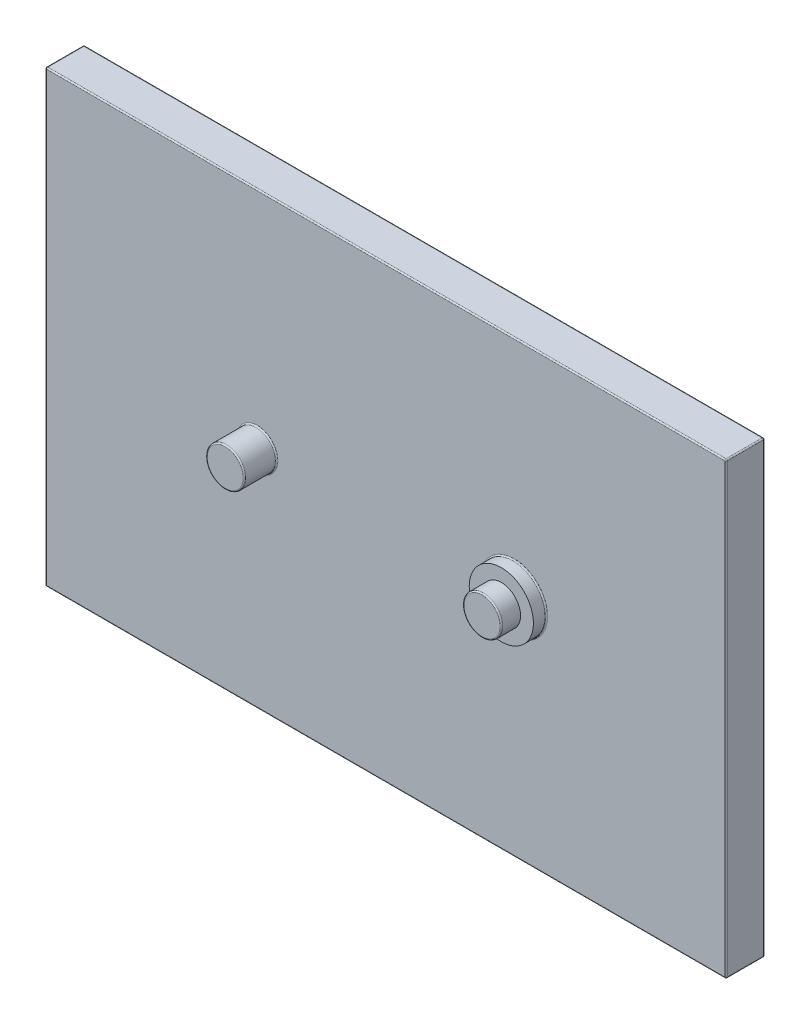
ISO-10303-21;
HEADER;
FILE_DESCRIPTION(('STEP AP214'),'2;1');
FILE_NAME('part.step','',(''),(''),'','','');
FILE_SCHEMA(('AUTOMOTIVE_DESIGN { 1 0 10303 214 1 1 1 1 }'));
ENDSEC;
DATA;
#1=APPLICATION_CONTEXT('core data for automotive mechanical design processes');
#2=APPLICATION_PROTOCOL_DEFINITION('international standard','automotive_design',2000,#1);
#3=PRODUCT_CONTEXT('',#1,'mechanical');
#4=PRODUCT('Part','Part','',(#3));
#5=PRODUCT_RELATED_PRODUCT_CATEGORY('part','',(#4));
#6=PRODUCT_DEFINITION_FORMATION('','',#4);
#7=PRODUCT_DEFINITION_CONTEXT('part definition',#1,'design');
#8=PRODUCT_DEFINITION('design','',#6,#7);
#9=PRODUCT_DEFINITION_SHAPE('','',#8);
#10=(LENGTH_UNIT() NAMED_UNIT(*) SI_UNIT(.MILLI.,.METRE.));
#11=(NAMED_UNIT(*) PLANE_ANGLE_UNIT() SI_UNIT($,.RADIAN.));
#12=(NAMED_UNIT(*) SI_UNIT($,.STERADIAN.) SOLID_ANGLE_UNIT());
#13=UNCERTAINTY_MEASURE_WITH_UNIT(LENGTH_MEASURE(1.E-05),#10,'distance_accuracy_value','');
#14=(GEOMETRIC_REPRESENTATION_CONTEXT(3) GLOBAL_UNCERTAINTY_ASSIGNED_CONTEXT((#13)) GLOBAL_UNIT_ASSIGNED_CONTEXT((#10,
#11,#12)) REPRESENTATION_CONTEXT('',''));
#15=CARTESIAN_POINT('',(0.,0.,0.));
#16=DIRECTION('',(0.,0.,1.));
#17=DIRECTION('',(1.,0.,0.));
#18=AXIS2_PLACEMENT_3D('',#15,#16,#17);
#19=CARTESIAN_POINT('',(265.,-175.,-10.));
#20=DIRECTION('',(0.,0.,1.));
#21=DIRECTION('',(1.,0.,0.));
#22=AXIS2_PLACEMENT_3D('',#19,#20,#21);
#23=PLANE('',#22);
#24=CARTESIAN_POINT('',(100.,0.,-10.));
#25=DIRECTION('',(0.,0.,1.));
#26=DIRECTION('',(1.,0.,0.));
#27=AXIS2_PLACEMENT_3D('',#24,#25,#26);
#28=CIRCLE('',#27,26.);
#29=CARTESIAN_POINT('',(126.,0.,-10.));
#30=VERTEX_POINT('',#29);
#31=EDGE_CURVE('E11',#30,#30,#28,.F.);
#32=ORIENTED_EDGE('',*,*,#31,.T.);
#33=EDGE_LOOP('',(#32));
#34=FACE_BOUND('',#33,.T.);
#35=CARTESIAN_POINT('',(-100.,0.,-10.));
#36=DIRECTION('',(0.,0.,1.));
#37=DIRECTION('',(1.,0.,0.));
#38=AXIS2_PLACEMENT_3D('',#35,#36,#37);
#39=CIRCLE('',#38,16.);
#40=CARTESIAN_POINT('',(-84.,0.,-10.));
#41=VERTEX_POINT('',#40);
#42=EDGE_CURVE('E43',#41,#41,#39,.F.);
#43=ORIENTED_EDGE('',*,*,#42,.T.);
#44=EDGE_LOOP('',(#43));
#45=FACE_BOUND('',#44,.T.);
#46=DIRECTION('',(0.,-1.,0.));
#47=VECTOR('',#46,1.);
#48=CARTESIAN_POINT('',(-264.,-175.,-10.));
#49=LINE('',#48,#47);
#50=CARTESIAN_POINT('',(-264.,174.,-10.));
#51=VERTEX_POINT('',#50);
#52=CARTESIAN_POINT('',(-264.,-174.,-10.));
#53=VERTEX_POINT('',#52);
#54=EDGE_CURVE('E51',#51,#53,#49,.T.);
#55=ORIENTED_EDGE('',*,*,#54,.T.);
#56=DIRECTION('',(1.,0.,0.));
#57=VECTOR('',#56,1.);
#58=CARTESIAN_POINT('',(265.,-174.,-10.));
#59=LINE('',#58,#57);
#60=CARTESIAN_POINT('',(264.,-174.,-10.));
#61=VERTEX_POINT('',#60);
#62=EDGE_CURVE('E225',#53,#61,#59,.T.);
#63=ORIENTED_EDGE('',*,*,#62,.T.);
#64=DIRECTION('',(0.,1.,0.));
#65=VECTOR('',#64,1.);
#66=CARTESIAN_POINT('',(264.,-175.,-10.));
#67=LINE('',#66,#65);
#68=CARTESIAN_POINT('',(264.,174.,-10.));
#69=VERTEX_POINT('',#68);
#70=EDGE_CURVE('E221',#61,#69,#67,.T.);
#71=ORIENTED_EDGE('',*,*,#70,.T.);
#72=DIRECTION('',(-1.,0.,0.));
#73=VECTOR('',#72,1.);
#74=CARTESIAN_POINT('',(265.,174.,-10.));
#75=LINE('',#74,#73);
#76=EDGE_CURVE('E56',#69,#51,#75,.T.);
#77=ORIENTED_EDGE('',*,*,#76,.T.);
#78=EDGE_LOOP('',(#55,#63,#71,#77));
#79=FACE_BOUND('',#78,.T.);
#80=ADVANCED_FACE('F34',(#34,#45,#79),#23,.T.);
#81=CARTESIAN_POINT('',(265.,175.,-40.));
#82=DIRECTION('',(1.,0.,0.));
#83=DIRECTION('',(0.,0.,-1.));
#84=AXIS2_PLACEMENT_3D('',#81,#82,#83);
#85=PLANE('',#84);
#86=DIRECTION('',(0.,1.,0.));
#87=VECTOR('',#86,1.);
#88=CARTESIAN_POINT('',(265.,175.,-11.));
#89=LINE('',#88,#87);
#90=CARTESIAN_POINT('',(265.,174.,-11.));
#91=VERTEX_POINT('',#90);
#92=CARTESIAN_POINT('',(265.,-174.,-11.));
#93=VERTEX_POINT('',#92);
#94=EDGE_CURVE('E196',#91,#93,#89,.F.);
#95=ORIENTED_EDGE('',*,*,#94,.T.);
#96=DIRECTION('',(0.,0.,1.));
#97=VECTOR('',#96,1.);
#98=CARTESIAN_POINT('',(265.,-174.,-40.));
#99=LINE('',#98,#97);
#100=CARTESIAN_POINT('',(265.,-174.,-39.));
#101=VERTEX_POINT('',#100);
#102=EDGE_CURVE('E201',#93,#101,#99,.F.);
#103=ORIENTED_EDGE('',*,*,#102,.T.);
#104=DIRECTION('',(0.,1.,0.));
#105=VECTOR('',#104,1.);
#106=CARTESIAN_POINT('',(265.,175.,-39.));
#107=LINE('',#106,#105);
#108=CARTESIAN_POINT('',(265.,174.,-39.));
#109=VERTEX_POINT('',#108);
#110=EDGE_CURVE('E198',#101,#109,#107,.T.);
#111=ORIENTED_EDGE('',*,*,#110,.T.);
#112=DIRECTION('',(0.,0.,1.));
#113=VECTOR('',#112,1.);
#114=CARTESIAN_POINT('',(265.,174.,-40.));
#115=LINE('',#114,#113);
#116=EDGE_CURVE('E194',#109,#91,#115,.T.);
#117=ORIENTED_EDGE('',*,*,#116,.T.);
#118=EDGE_LOOP('',(#95,#103,#111,#117));
#119=FACE_BOUND('',#118,.T.);
#120=ADVANCED_FACE('F308',(#119),#85,.T.);
#121=CARTESIAN_POINT('',(-265.,-175.,-40.));
#122=DIRECTION('',(0.,-1.,0.));
#123=DIRECTION('',(0.,0.,-1.));
#124=AXIS2_PLACEMENT_3D('',#121,#122,#123);
#125=PLANE('',#124);
#126=DIRECTION('',(1.,0.,0.));
#127=VECTOR('',#126,1.);
#128=CARTESIAN_POINT('',(265.,-175.,-39.));
#129=LINE('',#128,#127);
#130=CARTESIAN_POINT('',(-264.,-175.,-39.));
#131=VERTEX_POINT('',#130);
#132=CARTESIAN_POINT('',(264.,-175.,-39.));
#133=VERTEX_POINT('',#132);
#134=EDGE_CURVE('E189',#131,#133,#129,.T.);
#135=ORIENTED_EDGE('',*,*,#134,.T.);
#136=DIRECTION('',(0.,0.,1.));
#137=VECTOR('',#136,1.);
#138=CARTESIAN_POINT('',(264.,-175.,-40.));
#139=LINE('',#138,#137);
#140=CARTESIAN_POINT('',(264.,-175.,-11.));
#141=VERTEX_POINT('',#140);
#142=EDGE_CURVE('E192',#133,#141,#139,.T.);
#143=ORIENTED_EDGE('',*,*,#142,.T.);
#144=DIRECTION('',(1.,0.,0.));
#145=VECTOR('',#144,1.);
#146=CARTESIAN_POINT('',(-265.,-175.,-11.));
#147=LINE('',#146,#145);
#148=CARTESIAN_POINT('',(-264.,-175.,-11.));
#149=VERTEX_POINT('',#148);
#150=EDGE_CURVE('E187',#141,#149,#147,.F.);
#151=ORIENTED_EDGE('',*,*,#150,.T.);
#152=DIRECTION('',(0.,0.,1.));
#153=VECTOR('',#152,1.);
#154=CARTESIAN_POINT('',(-264.,-175.,-40.));
#155=LINE('',#154,#153);
#156=EDGE_CURVE('E185',#149,#131,#155,.F.);
#157=ORIENTED_EDGE('',*,*,#156,.T.);
#158=EDGE_LOOP('',(#135,#143,#151,#157));
#159=FACE_BOUND('',#158,.T.);
#160=ADVANCED_FACE('F314',(#159),#125,.T.);
#161=CARTESIAN_POINT('',(-265.,175.,-40.));
#162=DIRECTION('',(-1.,0.,0.));
#163=DIRECTION('',(0.,0.,1.));
#164=AXIS2_PLACEMENT_3D('',#161,#162,#163);
#165=PLANE('',#164);
#166=DIRECTION('',(0.,-1.,0.));
#167=VECTOR('',#166,1.);
#168=CARTESIAN_POINT('',(-265.,-175.,-39.));
#169=LINE('',#168,#167);
#170=CARTESIAN_POINT('',(-265.,174.,-39.));
#171=VERTEX_POINT('',#170);
#172=CARTESIAN_POINT('',(-265.,-174.,-39.));
#173=VERTEX_POINT('',#172);
#174=EDGE_CURVE('E180',#171,#173,#169,.T.);
#175=ORIENTED_EDGE('',*,*,#174,.T.);
#176=DIRECTION('',(0.,0.,1.));
#177=VECTOR('',#176,1.);
#178=CARTESIAN_POINT('',(-265.,-174.,-40.));
#179=LINE('',#178,#177);
#180=CARTESIAN_POINT('',(-265.,-174.,-11.));
#181=VERTEX_POINT('',#180);
#182=EDGE_CURVE('E183',#173,#181,#179,.T.);
#183=ORIENTED_EDGE('',*,*,#182,.T.);
#184=DIRECTION('',(0.,-1.,0.));
#185=VECTOR('',#184,1.);
#186=CARTESIAN_POINT('',(-265.,175.,-11.));
#187=LINE('',#186,#185);
#188=CARTESIAN_POINT('',(-265.,174.,-11.));
#189=VERTEX_POINT('',#188);
#190=EDGE_CURVE('E178',#181,#189,#187,.F.);
#191=ORIENTED_EDGE('',*,*,#190,.T.);
#192=DIRECTION('',(0.,0.,1.));
#193=VECTOR('',#192,1.);
#194=CARTESIAN_POINT('',(-265.,174.,-40.));
#195=LINE('',#194,#193);
#196=EDGE_CURVE('E176',#189,#171,#195,.F.);
#197=ORIENTED_EDGE('',*,*,#196,.T.);
#198=EDGE_LOOP('',(#175,#183,#191,#197));
#199=FACE_BOUND('',#198,.T.);
#200=ADVANCED_FACE('F324',(#199),#165,.T.);
#201=CARTESIAN_POINT('',(-265.,175.,-40.));
#202=DIRECTION('',(0.,1.,0.));
#203=DIRECTION('',(0.,0.,1.));
#204=AXIS2_PLACEMENT_3D('',#201,#202,#203);
#205=PLANE('',#204);
#206=DIRECTION('',(-1.,0.,0.));
#207=VECTOR('',#206,1.);
#208=CARTESIAN_POINT('',(-265.,175.,-39.));
#209=LINE('',#208,#207);
#210=CARTESIAN_POINT('',(264.,175.,-39.));
#211=VERTEX_POINT('',#210);
#212=CARTESIAN_POINT('',(-264.,175.,-39.));
#213=VERTEX_POINT('',#212);
#214=EDGE_CURVE('E135',#211,#213,#209,.T.);
#215=ORIENTED_EDGE('',*,*,#214,.T.);
#216=DIRECTION('',(0.,0.,1.));
#217=VECTOR('',#216,1.);
#218=CARTESIAN_POINT('',(-264.,175.,-40.));
#219=LINE('',#218,#217);
#220=CARTESIAN_POINT('',(-264.,175.,-11.));
#221=VERTEX_POINT('',#220);
#222=EDGE_CURVE('E131',#213,#221,#219,.T.);
#223=ORIENTED_EDGE('',*,*,#222,.T.);
#224=DIRECTION('',(-1.,0.,0.));
#225=VECTOR('',#224,1.);
#226=CARTESIAN_POINT('',(-265.,175.,-11.));
#227=LINE('',#226,#225);
#228=CARTESIAN_POINT('',(264.,175.,-11.));
#229=VERTEX_POINT('',#228);
#230=EDGE_CURVE('E123',#221,#229,#227,.F.);
#231=ORIENTED_EDGE('',*,*,#230,.T.);
#232=DIRECTION('',(0.,0.,1.));
#233=VECTOR('',#232,1.);
#234=CARTESIAN_POINT('',(264.,175.,-40.));
#235=LINE('',#234,#233);
#236=EDGE_CURVE('E128',#229,#211,#235,.F.);
#237=ORIENTED_EDGE('',*,*,#236,.T.);
#238=EDGE_LOOP('',(#215,#223,#231,#237));
#239=FACE_BOUND('',#238,.T.);
#240=ADVANCED_FACE('F126',(#239),#205,.T.);
#241=CARTESIAN_POINT('',(265.,-175.,-40.));
#242=DIRECTION('',(0.,0.,1.));
#243=DIRECTION('',(1.,0.,0.));
#244=AXIS2_PLACEMENT_3D('',#241,#242,#243);
#245=PLANE('',#244);
#246=DIRECTION('',(0.,-1.,0.));
#247=VECTOR('',#246,1.);
#248=CARTESIAN_POINT('',(-264.,175.,-40.));
#249=LINE('',#248,#247);
#250=CARTESIAN_POINT('',(-264.,-174.,-40.));
#251=VERTEX_POINT('',#250);
#252=CARTESIAN_POINT('',(-264.,174.,-40.));
#253=VERTEX_POINT('',#252);
#254=EDGE_CURVE('E171',#251,#253,#249,.F.);
#255=ORIENTED_EDGE('',*,*,#254,.T.);
#256=DIRECTION('',(-1.,0.,0.));
#257=VECTOR('',#256,1.);
#258=CARTESIAN_POINT('',(265.,174.,-40.));
#259=LINE('',#258,#257);
#260=CARTESIAN_POINT('',(264.,174.,-40.));
#261=VERTEX_POINT('',#260);
#262=EDGE_CURVE('E173',#253,#261,#259,.F.);
#263=ORIENTED_EDGE('',*,*,#262,.T.);
#264=DIRECTION('',(0.,1.,0.));
#265=VECTOR('',#264,1.);
#266=CARTESIAN_POINT('',(264.,-175.,-40.));
#267=LINE('',#266,#265);
#268=CARTESIAN_POINT('',(264.,-174.,-40.));
#269=VERTEX_POINT('',#268);
#270=EDGE_CURVE('E167',#261,#269,#267,.F.);
#271=ORIENTED_EDGE('',*,*,#270,.T.);
#272=DIRECTION('',(1.,0.,0.));
#273=VECTOR('',#272,1.);
#274=CARTESIAN_POINT('',(-265.,-174.,-40.));
#275=LINE('',#274,#273);
#276=EDGE_CURVE('E169',#269,#251,#275,.F.);
#277=ORIENTED_EDGE('',*,*,#276,.T.);
#278=EDGE_LOOP('',(#255,#263,#271,#277));
#279=FACE_BOUND('',#278,.T.);
#280=ADVANCED_FACE('F320',(#279),#245,.F.);
#281=CARTESIAN_POINT('',(-100.,0.,57.4264068711929));
#282=DIRECTION('',(0.,0.,-1.));
#283=DIRECTION('',(-1.,0.,0.));
#284=AXIS2_PLACEMENT_3D('',#281,#282,#283);
#285=CYLINDRICAL_SURFACE('',#284,15.);
#286=CARTESIAN_POINT('',(-100.,0.,14.));
#287=DIRECTION('',(0.,0.,-1.));
#288=DIRECTION('',(-1.,0.,0.));
#289=AXIS2_PLACEMENT_3D('',#286,#287,#288);
#290=CIRCLE('',#289,15.);
#291=CARTESIAN_POINT('',(-115.,0.,14.));
#292=VERTEX_POINT('',#291);
#293=EDGE_CURVE('E212',#292,#292,#290,.T.);
#294=ORIENTED_EDGE('',*,*,#293,.T.);
#295=EDGE_LOOP('',(#294));
#296=FACE_BOUND('',#295,.T.);
#297=CARTESIAN_POINT('',(-100.,0.,-9.));
#298=DIRECTION('',(0.,0.,1.));
#299=DIRECTION('',(1.,0.,0.));
#300=AXIS2_PLACEMENT_3D('',#297,#298,#299);
#301=CIRCLE('',#300,15.);
#302=CARTESIAN_POINT('',(-85.,0.,-9.));
#303=VERTEX_POINT('',#302);
#304=EDGE_CURVE('E209',#303,#303,#301,.T.);
#305=ORIENTED_EDGE('',*,*,#304,.T.);
#306=EDGE_LOOP('',(#305));
#307=FACE_BOUND('',#306,.T.);
#308=ADVANCED_FACE('F426',(#296,#307),#285,.T.);
#309=CARTESIAN_POINT('',(-42.5,57.5,15.));
#310=DIRECTION('',(0.,0.,-1.));
#311=DIRECTION('',(-1.,0.,0.));
#312=AXIS2_PLACEMENT_3D('',#309,#310,#311);
#313=PLANE('',#312);
#314=CARTESIAN_POINT('',(-100.,0.,15.));
#315=DIRECTION('',(0.,0.,-1.));
#316=DIRECTION('',(-1.,0.,0.));
#317=AXIS2_PLACEMENT_3D('',#314,#315,#316);
#318=CIRCLE('',#317,14.);
#319=CARTESIAN_POINT('',(-114.,0.,15.));
#320=VERTEX_POINT('',#319);
#321=EDGE_CURVE('E215',#320,#320,#318,.F.);
#322=ORIENTED_EDGE('',*,*,#321,.T.);
#323=EDGE_LOOP('',(#322));
#324=FACE_BOUND('',#323,.T.);
#325=ADVANCED_FACE('F305',(#324),#313,.F.);
#326=CARTESIAN_POINT('',(70.7106781186548,29.2893218813452,0.));
#327=DIRECTION('',(0.,0.,1.));
#328=DIRECTION('',(1.,0.,0.));
#329=AXIS2_PLACEMENT_3D('',#326,#327,#328);
#330=PLANE('',#329);
#331=CARTESIAN_POINT('',(100.,0.,0.));
#332=DIRECTION('',(0.,0.,1.));
#333=DIRECTION('',(1.,0.,0.));
#334=AXIS2_PLACEMENT_3D('',#331,#332,#333);
#335=CIRCLE('',#334,25.);
#336=CARTESIAN_POINT('',(75.,0.,0.));
#337=VERTEX_POINT('',#336);
#338=EDGE_CURVE('E161',#337,#337,#335,.T.);
#339=ORIENTED_EDGE('',*,*,#338,.T.);
#340=EDGE_LOOP('',(#339));
#341=FACE_BOUND('',#340,.T.);
#342=CARTESIAN_POINT('',(100.,0.,0.));
#343=DIRECTION('',(0.,0.,1.));
#344=DIRECTION('',(1.,0.,0.));
#345=AXIS2_PLACEMENT_3D('',#342,#343,#344);
#346=CIRCLE('',#345,15.);
#347=CARTESIAN_POINT('',(115.,0.,0.));
#348=VERTEX_POINT('',#347);
#349=EDGE_CURVE('E158',#348,#348,#346,.T.);
#350=ORIENTED_EDGE('',*,*,#349,.F.);
#351=EDGE_LOOP('',(#350));
#352=FACE_BOUND('',#351,.T.);
#353=ADVANCED_FACE('F290',(#341,#352),#330,.T.);
#354=CARTESIAN_POINT('',(100.,0.,70.7106781186547));
#355=DIRECTION('',(0.,0.,-1.));
#356=DIRECTION('',(-1.,0.,0.));
#357=AXIS2_PLACEMENT_3D('',#354,#355,#356);
#358=CYLINDRICAL_SURFACE('',#357,25.);
#359=CARTESIAN_POINT('',(100.,0.,-8.99999999999999));
#360=DIRECTION('',(0.,0.,1.));
#361=DIRECTION('',(1.,0.,0.));
#362=AXIS2_PLACEMENT_3D('',#359,#360,#361);
#363=CIRCLE('',#362,25.);
#364=CARTESIAN_POINT('',(75.,0.,-9.00000000000001));
#365=VERTEX_POINT('',#364);
#366=EDGE_CURVE('E218',#365,#365,#363,.T.);
#367=CARTESIAN_POINT('',(75.,0.,-9.00000000000001));
#368=CARTESIAN_POINT('',(75.,0.,-8.90625000000001));
#369=CARTESIAN_POINT('',(75.,0.,-8.81250000000001));
#370=CARTESIAN_POINT('',(75.,0.,-8.62500000000001));
#371=CARTESIAN_POINT('',(75.,0.,-8.53125000000001));
#372=CARTESIAN_POINT('',(75.,0.,-8.34375000000001));
#373=CARTESIAN_POINT('',(75.,0.,-8.25000000000001));
#374=CARTESIAN_POINT('',(75.,0.,-8.06250000000001));
#375=CARTESIAN_POINT('',(75.,0.,-7.96875000000001));
#376=CARTESIAN_POINT('',(75.,0.,-7.78125000000001));
#377=CARTESIAN_POINT('',(75.,0.,-7.68750000000001));
#378=CARTESIAN_POINT('',(75.,0.,-7.50000000000001));
#379=CARTESIAN_POINT('',(75.,0.,-7.40625));
#380=CARTESIAN_POINT('',(75.,0.,-7.21875));
#381=CARTESIAN_POINT('',(75.,0.,-7.125));
#382=CARTESIAN_POINT('',(75.,0.,-6.9375));
#383=CARTESIAN_POINT('',(75.,0.,-6.84375000000001));
#384=CARTESIAN_POINT('',(75.,0.,-6.65625000000001));
#385=CARTESIAN_POINT('',(75.,0.,-6.56250000000001));
#386=CARTESIAN_POINT('',(75.,0.,-6.37500000000001));
#387=CARTESIAN_POINT('',(75.,0.,-6.28125000000001));
#388=CARTESIAN_POINT('',(75.,0.,-6.09375000000001));
#389=CARTESIAN_POINT('',(75.,0.,-6.00000000000001));
#390=CARTESIAN_POINT('',(75.,0.,-5.8125));
#391=CARTESIAN_POINT('',(75.,0.,-5.71875));
#392=CARTESIAN_POINT('',(75.,0.,-5.53125000000001));
#393=CARTESIAN_POINT('',(75.,0.,-5.43750000000001));
#394=CARTESIAN_POINT('',(75.,0.,-5.25));
#395=CARTESIAN_POINT('',(75.,0.,-5.15625));
#396=CARTESIAN_POINT('',(75.,0.,-4.96875));
#397=CARTESIAN_POINT('',(75.,0.,-4.875));
#398=CARTESIAN_POINT('',(75.,0.,-4.6875));
#399=CARTESIAN_POINT('',(75.,0.,-4.59375));
#400=CARTESIAN_POINT('',(75.,0.,-4.40625));
#401=CARTESIAN_POINT('',(75.,0.,-4.31250000000001));
#402=CARTESIAN_POINT('',(75.,0.,-4.12500000000001));
#403=CARTESIAN_POINT('',(75.,0.,-4.03125000000001));
#404=CARTESIAN_POINT('',(75.,0.,-3.84375000000001));
#405=CARTESIAN_POINT('',(75.,0.,-3.75));
#406=CARTESIAN_POINT('',(75.,0.,-3.5625));
#407=CARTESIAN_POINT('',(75.,0.,-3.46875));
#408=CARTESIAN_POINT('',(75.,0.,-3.28125));
#409=CARTESIAN_POINT('',(75.,0.,-3.1875));
#410=CARTESIAN_POINT('',(75.,0.,-3.));
#411=CARTESIAN_POINT('',(75.,0.,-2.90625));
#412=CARTESIAN_POINT('',(75.,0.,-2.71875));
#413=CARTESIAN_POINT('',(75.,0.,-2.625));
#414=CARTESIAN_POINT('',(75.,0.,-2.4375));
#415=CARTESIAN_POINT('',(75.,0.,-2.34375));
#416=CARTESIAN_POINT('',(75.,0.,-2.15625));
#417=CARTESIAN_POINT('',(75.,0.,-2.0625));
#418=CARTESIAN_POINT('',(75.,0.,-1.87500000000001));
#419=CARTESIAN_POINT('',(75.,0.,-1.78125000000001));
#420=CARTESIAN_POINT('',(75.,0.,-1.59375));
#421=CARTESIAN_POINT('',(75.,0.,-1.5));
#422=CARTESIAN_POINT('',(75.,0.,-1.3125));
#423=CARTESIAN_POINT('',(75.,0.,-1.21875));
#424=CARTESIAN_POINT('',(75.,0.,-1.03125));
#425=CARTESIAN_POINT('',(75.,0.,-0.937500000000003));
#426=CARTESIAN_POINT('',(75.,0.,-0.750000000000001));
#427=CARTESIAN_POINT('',(75.,0.,-0.656249999999997));
#428=CARTESIAN_POINT('',(75.,0.,-0.468749999999995));
#429=CARTESIAN_POINT('',(75.,0.,-0.374999999999996));
#430=CARTESIAN_POINT('',(75.,0.,-0.187499999999998));
#431=CARTESIAN_POINT('',(75.,0.,-0.0937499999999989));
#432=CARTESIAN_POINT('',(75.,0.,0.));
#433=B_SPLINE_CURVE_WITH_KNOTS('',3,(#367,#368,#369,#370,#371,#372,#373,#374,#375,#376,#377,
#378,#379,#380,#381,#382,#383,#384,#385,#386,#387,#388,#389,#390,#391,#392,#393,#394,#395,#396,
#397,#398,#399,#400,#401,#402,#403,#404,#405,#406,#407,#408,#409,#410,#411,#412,#413,#414,#415,
#416,#417,#418,#419,#420,#421,#422,#423,#424,#425,#426,#427,#428,#429,#430,#431,#432),
.UNSPECIFIED.,.F.,.F.,(4,2,2,2,2,2,2,2,2,2,2,2,2,2,2,2,2,2,2,2,2,2,2,2,2,2,2,2,2,2,2,2,4),(0.,
0.281249999999997,0.562499999999994,0.843750000000004,1.125,1.40625,1.68750000000001,
1.96875000000001,2.25,2.53125,2.8125,3.09375000000001,3.375,3.65625,3.93750000000001,
4.21875000000001,4.5,4.78125,5.0625,5.34375000000001,5.62500000000001,5.90625,6.18750000000001,
6.46875000000001,6.75000000000001,7.03125,7.3125,7.59375000000001,7.87500000000001,8.15625,
8.43750000000001,8.71875000000001,9.00000000000001),.UNSPECIFIED.);
#434=EDGE_CURVE('BSEAM293',#365,#337,#433,.T.);
#435=ORIENTED_EDGE('',*,*,#366,.T.);
#436=ORIENTED_EDGE('',*,*,#338,.F.);
#437=ORIENTED_EDGE('',*,*,#434,.T.);
#438=ORIENTED_EDGE('',*,*,#434,.F.);
#439=EDGE_LOOP('',(#435,#437,#436,#438));
#440=FACE_BOUND('',#439,.T.);
#441=ADVANCED_FACE('F293',(#440),#358,.T.);
#442=CARTESIAN_POINT('',(-42.5,57.5,15.));
#443=DIRECTION('',(0.,0.,-1.));
#444=DIRECTION('',(-1.,0.,0.));
#445=AXIS2_PLACEMENT_3D('',#442,#443,#444);
#446=PLANE('',#445);
#447=CARTESIAN_POINT('',(100.,0.,15.));
#448=DIRECTION('',(0.,0.,-1.));
#449=DIRECTION('',(-1.,0.,0.));
#450=AXIS2_PLACEMENT_3D('',#447,#448,#449);
#451=CIRCLE('',#450,14.);
#452=CARTESIAN_POINT('',(86.,0.,15.));
#453=VERTEX_POINT('',#452);
#454=EDGE_CURVE('E206',#453,#453,#451,.F.);
#455=ORIENTED_EDGE('',*,*,#454,.T.);
#456=EDGE_LOOP('',(#455));
#457=FACE_BOUND('',#456,.T.);
#458=ADVANCED_FACE('F295',(#457),#446,.F.);
#459=CARTESIAN_POINT('',(100.,0.,57.4264068711929));
#460=DIRECTION('',(0.,0.,-1.));
#461=DIRECTION('',(-1.,0.,0.));
#462=AXIS2_PLACEMENT_3D('',#459,#460,#461);
#463=CYLINDRICAL_SURFACE('',#462,15.);
#464=CARTESIAN_POINT('',(100.,0.,14.));
#465=DIRECTION('',(0.,0.,-1.));
#466=DIRECTION('',(-1.,0.,0.));
#467=AXIS2_PLACEMENT_3D('',#464,#465,#466);
#468=CIRCLE('',#467,15.);
#469=CARTESIAN_POINT('',(85.,0.,14.));
#470=VERTEX_POINT('',#469);
#471=EDGE_CURVE('E203',#470,#470,#468,.T.);
#472=ORIENTED_EDGE('',*,*,#471,.T.);
#473=EDGE_LOOP('',(#472));
#474=FACE_BOUND('',#473,.T.);
#475=ORIENTED_EDGE('',*,*,#349,.T.);
#476=EDGE_LOOP('',(#475));
#477=FACE_BOUND('',#476,.T.);
#478=ADVANCED_FACE('F302',(#474,#477),#463,.T.);
#479=CARTESIAN_POINT('',(265.,-174.,-11.));
#480=DIRECTION('',(1.,0.,0.));
#481=DIRECTION('',(0.,0.,-1.));
#482=AXIS2_PLACEMENT_3D('',#479,#480,#481);
#483=CYLINDRICAL_SURFACE('',#482,1.);
#484=CARTESIAN_POINT('',(264.,-174.,-11.));
#485=DIRECTION('',(1.,0.,0.));
#486=DIRECTION('',(0.,0.,-1.));
#487=AXIS2_PLACEMENT_3D('',#484,#485,#486);
#488=CIRCLE('',#487,1.);
#489=EDGE_CURVE('E38',#61,#141,#488,.T.);
#490=ORIENTED_EDGE('',*,*,#489,.F.);
#491=ORIENTED_EDGE('',*,*,#62,.F.);
#492=CARTESIAN_POINT('',(-264.,-174.,-11.));
#493=DIRECTION('',(-1.,0.,0.));
#494=DIRECTION('',(0.,0.,1.));
#495=AXIS2_PLACEMENT_3D('',#492,#493,#494);
#496=CIRCLE('',#495,1.);
#497=EDGE_CURVE('E276',#149,#53,#496,.T.);
#498=ORIENTED_EDGE('',*,*,#497,.F.);
#499=ORIENTED_EDGE('',*,*,#150,.F.);
#500=EDGE_LOOP('',(#490,#491,#498,#499));
#501=FACE_BOUND('',#500,.T.);
#502=ADVANCED_FACE('F400',(#501),#483,.T.);
#503=CARTESIAN_POINT('',(264.,-174.,-11.));
#504=DIRECTION('',(0.,0.,1.));
#505=DIRECTION('',(1.,0.,0.));
#506=AXIS2_PLACEMENT_3D('',#503,#504,#505);
#507=SPHERICAL_SURFACE('',#506,1.);
#508=CARTESIAN_POINT('',(264.,-174.,-11.));
#509=DIRECTION('',(0.,-1.,0.));
#510=DIRECTION('',(0.,0.,-1.));
#511=AXIS2_PLACEMENT_3D('',#508,#509,#510);
#512=CIRCLE('',#511,1.);
#513=EDGE_CURVE('E271',#61,#93,#512,.F.);
#514=ORIENTED_EDGE('',*,*,#513,.F.);
#515=ORIENTED_EDGE('',*,*,#489,.T.);
#516=CARTESIAN_POINT('',(264.,-174.,-11.));
#517=DIRECTION('',(0.,0.,1.));
#518=DIRECTION('',(1.,0.,0.));
#519=AXIS2_PLACEMENT_3D('',#516,#517,#518);
#520=CIRCLE('',#519,1.);
#521=EDGE_CURVE('E274',#93,#141,#520,.F.);
#522=ORIENTED_EDGE('',*,*,#521,.F.);
#523=EDGE_LOOP('',(#514,#515,#522));
#524=FACE_BOUND('',#523,.T.);
#525=ADVANCED_FACE('F397',(#524),#507,.T.);
#526=CARTESIAN_POINT('',(-264.,-174.,-11.));
#527=DIRECTION('',(0.,0.,1.));
#528=DIRECTION('',(1.,0.,0.));
#529=AXIS2_PLACEMENT_3D('',#526,#527,#528);
#530=SPHERICAL_SURFACE('',#529,1.);
#531=CARTESIAN_POINT('',(-264.,-174.,-11.));
#532=DIRECTION('',(0.,0.,1.));
#533=DIRECTION('',(1.,0.,0.));
#534=AXIS2_PLACEMENT_3D('',#531,#532,#533);
#535=CIRCLE('',#534,1.);
#536=EDGE_CURVE('E265',#149,#181,#535,.F.);
#537=ORIENTED_EDGE('',*,*,#536,.F.);
#538=ORIENTED_EDGE('',*,*,#497,.T.);
#539=CARTESIAN_POINT('',(-264.,-174.,-11.));
#540=DIRECTION('',(0.,-1.,0.));
#541=DIRECTION('',(0.,0.,-1.));
#542=AXIS2_PLACEMENT_3D('',#539,#540,#541);
#543=CIRCLE('',#542,1.);
#544=EDGE_CURVE('E268',#181,#53,#543,.F.);
#545=ORIENTED_EDGE('',*,*,#544,.F.);
#546=EDGE_LOOP('',(#537,#538,#545));
#547=FACE_BOUND('',#546,.T.);
#548=ADVANCED_FACE('F393',(#547),#530,.T.);
#549=CARTESIAN_POINT('',(264.,-174.,-40.));
#550=DIRECTION('',(0.,0.,1.));
#551=DIRECTION('',(1.,0.,0.));
#552=AXIS2_PLACEMENT_3D('',#549,#550,#551);
#553=CYLINDRICAL_SURFACE('',#552,1.);
#554=ORIENTED_EDGE('',*,*,#521,.T.);
#555=ORIENTED_EDGE('',*,*,#142,.F.);
#556=CARTESIAN_POINT('',(264.,-174.,-39.));
#557=DIRECTION('',(0.,0.,-1.));
#558=DIRECTION('',(-1.,0.,0.));
#559=AXIS2_PLACEMENT_3D('',#556,#557,#558);
#560=CIRCLE('',#559,1.);
#561=EDGE_CURVE('E260',#101,#133,#560,.T.);
#562=ORIENTED_EDGE('',*,*,#561,.F.);
#563=ORIENTED_EDGE('',*,*,#102,.F.);
#564=EDGE_LOOP('',(#554,#555,#562,#563));
#565=FACE_BOUND('',#564,.T.);
#566=ADVANCED_FACE('F389',(#565),#553,.T.);
#567=CARTESIAN_POINT('',(264.,-175.,-11.));
#568=DIRECTION('',(0.,1.,0.));
#569=DIRECTION('',(0.,0.,1.));
#570=AXIS2_PLACEMENT_3D('',#567,#568,#569);
#571=CYLINDRICAL_SURFACE('',#570,1.);
#572=ORIENTED_EDGE('',*,*,#513,.T.);
#573=ORIENTED_EDGE('',*,*,#94,.F.);
#574=CARTESIAN_POINT('',(264.,174.,-11.));
#575=DIRECTION('',(0.,1.,0.));
#576=DIRECTION('',(0.,0.,1.));
#577=AXIS2_PLACEMENT_3D('',#574,#575,#576);
#578=CIRCLE('',#577,1.);
#579=EDGE_CURVE('E144',#69,#91,#578,.T.);
#580=ORIENTED_EDGE('',*,*,#579,.F.);
#581=ORIENTED_EDGE('',*,*,#70,.F.);
#582=EDGE_LOOP('',(#572,#573,#580,#581));
#583=FACE_BOUND('',#582,.T.);
#584=ADVANCED_FACE('F386',(#583),#571,.T.);
#585=CARTESIAN_POINT('',(265.,174.,-11.));
#586=DIRECTION('',(-1.,0.,0.));
#587=DIRECTION('',(0.,0.,1.));
#588=AXIS2_PLACEMENT_3D('',#585,#586,#587);
#589=CYLINDRICAL_SURFACE('',#588,1.);
#590=CARTESIAN_POINT('',(-264.,174.,-11.));
#591=DIRECTION('',(-1.,0.,0.));
#592=DIRECTION('',(0.,0.,1.));
#593=AXIS2_PLACEMENT_3D('',#590,#591,#592);
#594=CIRCLE('',#593,1.);
#595=EDGE_CURVE('E145',#51,#221,#594,.T.);
#596=ORIENTED_EDGE('',*,*,#595,.F.);
#597=ORIENTED_EDGE('',*,*,#76,.F.);
#598=CARTESIAN_POINT('',(264.,174.,-11.));
#599=DIRECTION('',(1.,0.,0.));
#600=DIRECTION('',(0.,0.,-1.));
#601=AXIS2_PLACEMENT_3D('',#598,#599,#600);
#602=CIRCLE('',#601,1.);
#603=EDGE_CURVE('E138',#229,#69,#602,.T.);
#604=ORIENTED_EDGE('',*,*,#603,.F.);
#605=ORIENTED_EDGE('',*,*,#230,.F.);
#606=EDGE_LOOP('',(#596,#597,#604,#605));
#607=FACE_BOUND('',#606,.T.);
#608=ADVANCED_FACE('F140',(#607),#589,.T.);
#609=CARTESIAN_POINT('',(-264.,-175.,-11.));
#610=DIRECTION('',(0.,-1.,0.));
#611=DIRECTION('',(0.,0.,-1.));
#612=AXIS2_PLACEMENT_3D('',#609,#610,#611);
#613=CYLINDRICAL_SURFACE('',#612,1.);
#614=ORIENTED_EDGE('',*,*,#544,.T.);
#615=ORIENTED_EDGE('',*,*,#54,.F.);
#616=CARTESIAN_POINT('',(-264.,174.,-11.));
#617=DIRECTION('',(0.,1.,0.));
#618=DIRECTION('',(0.,0.,1.));
#619=AXIS2_PLACEMENT_3D('',#616,#617,#618);
#620=CIRCLE('',#619,1.);
#621=EDGE_CURVE('E255',#189,#51,#620,.T.);
#622=ORIENTED_EDGE('',*,*,#621,.F.);
#623=ORIENTED_EDGE('',*,*,#190,.F.);
#624=EDGE_LOOP('',(#614,#615,#622,#623));
#625=FACE_BOUND('',#624,.T.);
#626=ADVANCED_FACE('F379',(#625),#613,.T.);
#627=CARTESIAN_POINT('',(-264.,-174.,-40.));
#628=DIRECTION('',(0.,0.,1.));
#629=DIRECTION('',(1.,0.,0.));
#630=AXIS2_PLACEMENT_3D('',#627,#628,#629);
#631=CYLINDRICAL_SURFACE('',#630,1.);
#632=ORIENTED_EDGE('',*,*,#536,.T.);
#633=ORIENTED_EDGE('',*,*,#182,.F.);
#634=CARTESIAN_POINT('',(-264.,-174.,-39.));
#635=DIRECTION('',(0.,0.,-1.));
#636=DIRECTION('',(-1.,0.,0.));
#637=AXIS2_PLACEMENT_3D('',#634,#635,#636);
#638=CIRCLE('',#637,1.);
#639=EDGE_CURVE('E252',#131,#173,#638,.T.);
#640=ORIENTED_EDGE('',*,*,#639,.F.);
#641=ORIENTED_EDGE('',*,*,#156,.F.);
#642=EDGE_LOOP('',(#632,#633,#640,#641));
#643=FACE_BOUND('',#642,.T.);
#644=ADVANCED_FACE('F375',(#643),#631,.T.);
#645=CARTESIAN_POINT('',(-265.,-174.,-39.));
#646=DIRECTION('',(-1.,0.,0.));
#647=DIRECTION('',(0.,0.,1.));
#648=AXIS2_PLACEMENT_3D('',#645,#646,#647);
#649=CYLINDRICAL_SURFACE('',#648,1.);
#650=CARTESIAN_POINT('',(264.,-174.,-39.));
#651=DIRECTION('',(1.,0.,0.));
#652=DIRECTION('',(0.,0.,-1.));
#653=AXIS2_PLACEMENT_3D('',#650,#651,#652);
#654=CIRCLE('',#653,1.);
#655=EDGE_CURVE('E262',#133,#269,#654,.T.);
#656=ORIENTED_EDGE('',*,*,#655,.F.);
#657=ORIENTED_EDGE('',*,*,#134,.F.);
#658=CARTESIAN_POINT('',(-264.,-174.,-39.));
#659=DIRECTION('',(-1.,0.,0.));
#660=DIRECTION('',(0.,0.,1.));
#661=AXIS2_PLACEMENT_3D('',#658,#659,#660);
#662=CIRCLE('',#661,1.);
#663=EDGE_CURVE('E249',#251,#131,#662,.T.);
#664=ORIENTED_EDGE('',*,*,#663,.F.);
#665=ORIENTED_EDGE('',*,*,#276,.F.);
#666=EDGE_LOOP('',(#656,#657,#664,#665));
#667=FACE_BOUND('',#666,.T.);
#668=ADVANCED_FACE('F371',(#667),#649,.T.);
#669=CARTESIAN_POINT('',(264.,-174.,-39.));
#670=DIRECTION('',(0.,0.,1.));
#671=DIRECTION('',(1.,0.,0.));
#672=AXIS2_PLACEMENT_3D('',#669,#670,#671);
#673=SPHERICAL_SURFACE('',#672,1.);
#674=ORIENTED_EDGE('',*,*,#561,.T.);
#675=ORIENTED_EDGE('',*,*,#655,.T.);
#676=CARTESIAN_POINT('',(264.,-174.,-39.));
#677=DIRECTION('',(0.,-1.,0.));
#678=DIRECTION('',(0.,0.,-1.));
#679=AXIS2_PLACEMENT_3D('',#676,#677,#678);
#680=CIRCLE('',#679,1.);
#681=EDGE_CURVE('E152',#101,#269,#680,.F.);
#682=ORIENTED_EDGE('',*,*,#681,.F.);
#683=EDGE_LOOP('',(#674,#675,#682));
#684=FACE_BOUND('',#683,.T.);
#685=ADVANCED_FACE('F368',(#684),#673,.T.);
#686=CARTESIAN_POINT('',(264.,174.,-11.));
#687=DIRECTION('',(0.,0.,1.));
#688=DIRECTION('',(1.,0.,0.));
#689=AXIS2_PLACEMENT_3D('',#686,#687,#688);
#690=SPHERICAL_SURFACE('',#689,1.);
#691=ORIENTED_EDGE('',*,*,#603,.T.);
#692=ORIENTED_EDGE('',*,*,#579,.T.);
#693=CARTESIAN_POINT('',(264.,174.,-11.));
#694=DIRECTION('',(0.,0.,1.));
#695=DIRECTION('',(1.,0.,0.));
#696=AXIS2_PLACEMENT_3D('',#693,#694,#695);
#697=CIRCLE('',#696,1.);
#698=EDGE_CURVE('E148',#229,#91,#697,.F.);
#699=ORIENTED_EDGE('',*,*,#698,.F.);
#700=EDGE_LOOP('',(#691,#692,#699));
#701=FACE_BOUND('',#700,.T.);
#702=ADVANCED_FACE('F149',(#701),#690,.T.);
#703=CARTESIAN_POINT('',(-264.,174.,-11.));
#704=DIRECTION('',(0.,0.,1.));
#705=DIRECTION('',(1.,0.,0.));
#706=AXIS2_PLACEMENT_3D('',#703,#704,#705);
#707=SPHERICAL_SURFACE('',#706,1.);
#708=ORIENTED_EDGE('',*,*,#621,.T.);
#709=ORIENTED_EDGE('',*,*,#595,.T.);
#710=CARTESIAN_POINT('',(-264.,174.,-11.));
#711=DIRECTION('',(0.,0.,1.));
#712=DIRECTION('',(1.,0.,0.));
#713=AXIS2_PLACEMENT_3D('',#710,#711,#712);
#714=CIRCLE('',#713,1.);
#715=EDGE_CURVE('E153',#189,#221,#714,.F.);
#716=ORIENTED_EDGE('',*,*,#715,.F.);
#717=EDGE_LOOP('',(#708,#709,#716));
#718=FACE_BOUND('',#717,.T.);
#719=ADVANCED_FACE('F361',(#718),#707,.T.);
#720=CARTESIAN_POINT('',(-264.,-174.,-39.));
#721=DIRECTION('',(0.,0.,1.));
#722=DIRECTION('',(1.,0.,0.));
#723=AXIS2_PLACEMENT_3D('',#720,#721,#722);
#724=SPHERICAL_SURFACE('',#723,1.);
#725=ORIENTED_EDGE('',*,*,#663,.T.);
#726=ORIENTED_EDGE('',*,*,#639,.T.);
#727=CARTESIAN_POINT('',(-264.,-174.,-39.));
#728=DIRECTION('',(0.,-1.,0.));
#729=DIRECTION('',(0.,0.,-1.));
#730=AXIS2_PLACEMENT_3D('',#727,#728,#729);
#731=CIRCLE('',#730,1.);
#732=EDGE_CURVE('E243',#251,#173,#731,.F.);
#733=ORIENTED_EDGE('',*,*,#732,.F.);
#734=EDGE_LOOP('',(#725,#726,#733));
#735=FACE_BOUND('',#734,.T.);
#736=ADVANCED_FACE('F357',(#735),#724,.T.);
#737=CARTESIAN_POINT('',(264.,175.,-39.));
#738=DIRECTION('',(0.,-1.,0.));
#739=DIRECTION('',(0.,0.,-1.));
#740=AXIS2_PLACEMENT_3D('',#737,#738,#739);
#741=CYLINDRICAL_SURFACE('',#740,1.);
#742=ORIENTED_EDGE('',*,*,#681,.T.);
#743=ORIENTED_EDGE('',*,*,#270,.F.);
#744=CARTESIAN_POINT('',(264.,174.,-39.));
#745=DIRECTION('',(0.,1.,0.));
#746=DIRECTION('',(0.,0.,1.));
#747=AXIS2_PLACEMENT_3D('',#744,#745,#746);
#748=CIRCLE('',#747,1.);
#749=EDGE_CURVE('E240',#109,#261,#748,.T.);
#750=ORIENTED_EDGE('',*,*,#749,.F.);
#751=ORIENTED_EDGE('',*,*,#110,.F.);
#752=EDGE_LOOP('',(#742,#743,#750,#751));
#753=FACE_BOUND('',#752,.T.);
#754=ADVANCED_FACE('F354',(#753),#741,.T.);
#755=CARTESIAN_POINT('',(264.,174.,-40.));
#756=DIRECTION('',(0.,0.,1.));
#757=DIRECTION('',(1.,0.,0.));
#758=AXIS2_PLACEMENT_3D('',#755,#756,#757);
#759=CYLINDRICAL_SURFACE('',#758,1.);
#760=ORIENTED_EDGE('',*,*,#698,.T.);
#761=ORIENTED_EDGE('',*,*,#116,.F.);
#762=CARTESIAN_POINT('',(264.,174.,-39.));
#763=DIRECTION('',(0.,0.,-1.));
#764=DIRECTION('',(-1.,0.,0.));
#765=AXIS2_PLACEMENT_3D('',#762,#763,#764);
#766=CIRCLE('',#765,1.);
#767=EDGE_CURVE('E156',#211,#109,#766,.T.);
#768=ORIENTED_EDGE('',*,*,#767,.F.);
#769=ORIENTED_EDGE('',*,*,#236,.F.);
#770=EDGE_LOOP('',(#760,#761,#768,#769));
#771=FACE_BOUND('',#770,.T.);
#772=ADVANCED_FACE('F155',(#771),#759,.T.);
#773=CARTESIAN_POINT('',(-264.,174.,-40.));
#774=DIRECTION('',(0.,0.,1.));
#775=DIRECTION('',(1.,0.,0.));
#776=AXIS2_PLACEMENT_3D('',#773,#774,#775);
#777=CYLINDRICAL_SURFACE('',#776,1.);
#778=ORIENTED_EDGE('',*,*,#715,.T.);
#779=ORIENTED_EDGE('',*,*,#222,.F.);
#780=CARTESIAN_POINT('',(-264.,174.,-39.));
#781=DIRECTION('',(0.,0.,-1.));
#782=DIRECTION('',(-1.,0.,0.));
#783=AXIS2_PLACEMENT_3D('',#780,#781,#782);
#784=CIRCLE('',#783,1.);
#785=EDGE_CURVE('E236',#171,#213,#784,.T.);
#786=ORIENTED_EDGE('',*,*,#785,.F.);
#787=ORIENTED_EDGE('',*,*,#196,.F.);
#788=EDGE_LOOP('',(#778,#779,#786,#787));
#789=FACE_BOUND('',#788,.T.);
#790=ADVANCED_FACE('F347',(#789),#777,.T.);
#791=CARTESIAN_POINT('',(-264.,175.,-39.));
#792=DIRECTION('',(0.,1.,0.));
#793=DIRECTION('',(0.,0.,1.));
#794=AXIS2_PLACEMENT_3D('',#791,#792,#793);
#795=CYLINDRICAL_SURFACE('',#794,1.);
#796=ORIENTED_EDGE('',*,*,#732,.T.);
#797=ORIENTED_EDGE('',*,*,#174,.F.);
#798=CARTESIAN_POINT('',(-264.,174.,-39.));
#799=DIRECTION('',(0.,1.,0.));
#800=DIRECTION('',(0.,0.,1.));
#801=AXIS2_PLACEMENT_3D('',#798,#799,#800);
#802=CIRCLE('',#801,1.);
#803=EDGE_CURVE('E233',#253,#171,#802,.T.);
#804=ORIENTED_EDGE('',*,*,#803,.F.);
#805=ORIENTED_EDGE('',*,*,#254,.F.);
#806=EDGE_LOOP('',(#796,#797,#804,#805));
#807=FACE_BOUND('',#806,.T.);
#808=ADVANCED_FACE('F343',(#807),#795,.T.);
#809=CARTESIAN_POINT('',(264.,174.,-39.));
#810=DIRECTION('',(0.,0.,1.));
#811=DIRECTION('',(1.,0.,0.));
#812=AXIS2_PLACEMENT_3D('',#809,#810,#811);
#813=SPHERICAL_SURFACE('',#812,1.);
#814=ORIENTED_EDGE('',*,*,#767,.T.);
#815=ORIENTED_EDGE('',*,*,#749,.T.);
#816=CARTESIAN_POINT('',(264.,174.,-39.));
#817=DIRECTION('',(1.,0.,0.));
#818=DIRECTION('',(0.,0.,-1.));
#819=AXIS2_PLACEMENT_3D('',#816,#817,#818);
#820=CIRCLE('',#819,1.);
#821=EDGE_CURVE('E231',#211,#261,#820,.F.);
#822=ORIENTED_EDGE('',*,*,#821,.F.);
#823=EDGE_LOOP('',(#814,#815,#822));
#824=FACE_BOUND('',#823,.T.);
#825=ADVANCED_FACE('F339',(#824),#813,.T.);
#826=CARTESIAN_POINT('',(-264.,174.,-39.));
#827=DIRECTION('',(0.,0.,1.));
#828=DIRECTION('',(1.,0.,0.));
#829=AXIS2_PLACEMENT_3D('',#826,#827,#828);
#830=SPHERICAL_SURFACE('',#829,1.);
#831=ORIENTED_EDGE('',*,*,#803,.T.);
#832=ORIENTED_EDGE('',*,*,#785,.T.);
#833=CARTESIAN_POINT('',(-264.,174.,-39.));
#834=DIRECTION('',(-1.,0.,0.));
#835=DIRECTION('',(0.,0.,1.));
#836=AXIS2_PLACEMENT_3D('',#833,#834,#835);
#837=CIRCLE('',#836,1.);
#838=EDGE_CURVE('E229',#253,#213,#837,.F.);
#839=ORIENTED_EDGE('',*,*,#838,.F.);
#840=EDGE_LOOP('',(#831,#832,#839));
#841=FACE_BOUND('',#840,.T.);
#842=ADVANCED_FACE('F335',(#841),#830,.T.);
#843=CARTESIAN_POINT('',(-265.,174.,-39.));
#844=DIRECTION('',(1.,0.,0.));
#845=DIRECTION('',(0.,0.,-1.));
#846=AXIS2_PLACEMENT_3D('',#843,#844,#845);
#847=CYLINDRICAL_SURFACE('',#846,1.);
#848=ORIENTED_EDGE('',*,*,#821,.T.);
#849=ORIENTED_EDGE('',*,*,#262,.F.);
#850=ORIENTED_EDGE('',*,*,#838,.T.);
#851=ORIENTED_EDGE('',*,*,#214,.F.);
#852=EDGE_LOOP('',(#848,#849,#850,#851));
#853=FACE_BOUND('',#852,.T.);
#854=ADVANCED_FACE('F331',(#853),#847,.T.);
#855=CARTESIAN_POINT('',(100.,0.,14.));
#856=DIRECTION('',(0.,0.,-1.));
#857=DIRECTION('',(-1.,0.,0.));
#858=AXIS2_PLACEMENT_3D('',#855,#856,#857);
#859=TOROIDAL_SURFACE('',#858,14.,1.);
#860=ORIENTED_EDGE('',*,*,#454,.F.);
#861=EDGE_LOOP('',(#860));
#862=FACE_BOUND('',#861,.T.);
#863=ORIENTED_EDGE('',*,*,#471,.F.);
#864=EDGE_LOOP('',(#863));
#865=FACE_BOUND('',#864,.T.);
#866=ADVANCED_FACE('F334',(#862,#865),#859,.T.);
#867=CARTESIAN_POINT('',(-100.,0.,14.));
#868=DIRECTION('',(0.,0.,-1.));
#869=DIRECTION('',(-1.,0.,0.));
#870=AXIS2_PLACEMENT_3D('',#867,#868,#869);
#871=TOROIDAL_SURFACE('',#870,14.,1.);
#872=ORIENTED_EDGE('',*,*,#321,.F.);
#873=EDGE_LOOP('',(#872));
#874=FACE_BOUND('',#873,.T.);
#875=ORIENTED_EDGE('',*,*,#293,.F.);
#876=EDGE_LOOP('',(#875));
#877=FACE_BOUND('',#876,.T.);
#878=ADVANCED_FACE('F406',(#874,#877),#871,.T.);
#879=CARTESIAN_POINT('',(100.,0.,-8.99999999999999));
#880=DIRECTION('',(0.,0.,1.));
#881=DIRECTION('',(1.,0.,0.));
#882=AXIS2_PLACEMENT_3D('',#879,#880,#881);
#883=TOROIDAL_SURFACE('',#882,26.,1.);
#884=ORIENTED_EDGE('',*,*,#31,.F.);
#885=EDGE_LOOP('',(#884));
#886=FACE_BOUND('',#885,.T.);
#887=ORIENTED_EDGE('',*,*,#366,.F.);
#888=EDGE_LOOP('',(#887));
#889=FACE_BOUND('',#888,.T.);
#890=ADVANCED_FACE('F409',(#886,#889),#883,.F.);
#891=CARTESIAN_POINT('',(-100.,0.,-9.));
#892=DIRECTION('',(0.,0.,1.));
#893=DIRECTION('',(1.,0.,0.));
#894=AXIS2_PLACEMENT_3D('',#891,#892,#893);
#895=TOROIDAL_SURFACE('',#894,16.,1.);
#896=ORIENTED_EDGE('',*,*,#42,.F.);
#897=EDGE_LOOP('',(#896));
#898=FACE_BOUND('',#897,.T.);
#899=ORIENTED_EDGE('',*,*,#304,.F.);
#900=EDGE_LOOP('',(#899));
#901=FACE_BOUND('',#900,.T.);
#902=ADVANCED_FACE('F36',(#898,#901),#895,.F.);
#903=CLOSED_SHELL('',(#80,#120,#160,#200,#240,#280,#308,#325,#353,#441,#458,#478,#502,#525,#548,
#566,#584,#608,#626,#644,#668,#685,#702,#719,#736,#754,#772,#790,#808,#825,#842,#854,#866,#878,
#890,#902));
#904=MANIFOLD_SOLID_BREP('B2',#903);
#905=ADVANCED_BREP_SHAPE_REPRESENTATION('',(#18,#904),#14);
#906=SHAPE_DEFINITION_REPRESENTATION(#9,#905);
ENDSEC;
END-ISO-10303-21;
